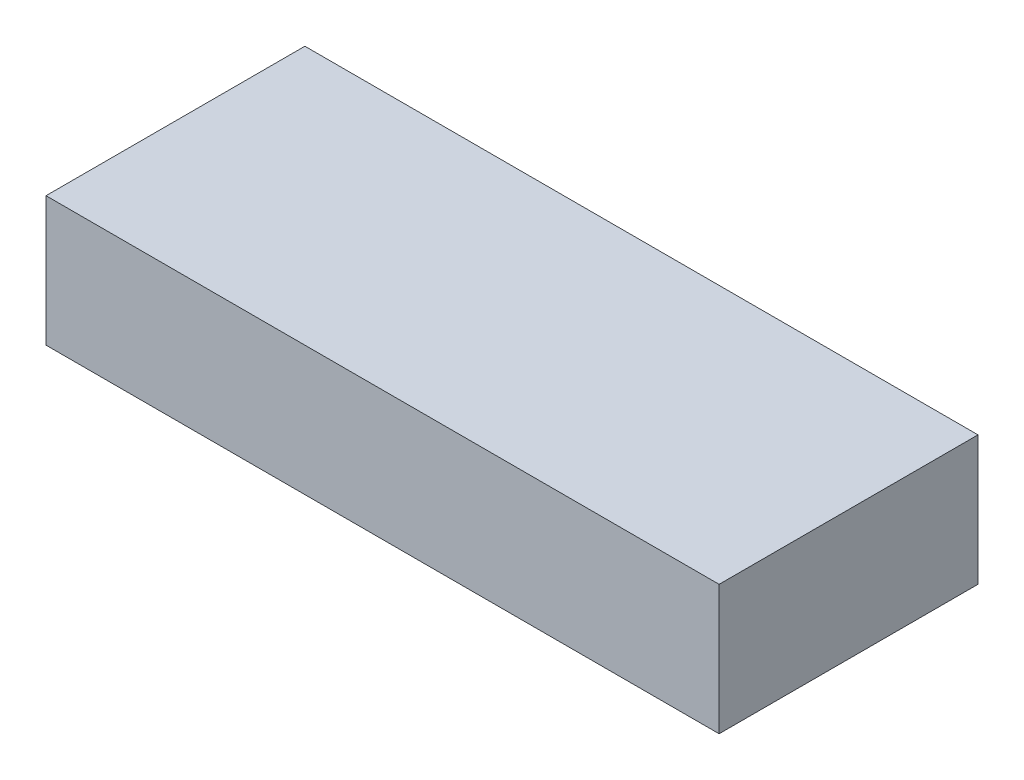
ISO-10303-21;
HEADER;
FILE_DESCRIPTION(('STEP AP214'),'2;1');
FILE_NAME('part.step','',(''),(''),'','','');
FILE_SCHEMA(('AUTOMOTIVE_DESIGN { 1 0 10303 214 1 1 1 1 }'));
ENDSEC;
DATA;
#1=APPLICATION_CONTEXT('core data for automotive mechanical design processes');
#2=APPLICATION_PROTOCOL_DEFINITION('international standard','automotive_design',2000,#1);
#3=PRODUCT_CONTEXT('',#1,'mechanical');
#4=PRODUCT('Part','Part','',(#3));
#5=PRODUCT_RELATED_PRODUCT_CATEGORY('part','',(#4));
#6=PRODUCT_DEFINITION_FORMATION('','',#4);
#7=PRODUCT_DEFINITION_CONTEXT('part definition',#1,'design');
#8=PRODUCT_DEFINITION('design','',#6,#7);
#9=PRODUCT_DEFINITION_SHAPE('','',#8);
#10=(LENGTH_UNIT() NAMED_UNIT(*) SI_UNIT(.MILLI.,.METRE.));
#11=(NAMED_UNIT(*) PLANE_ANGLE_UNIT() SI_UNIT($,.RADIAN.));
#12=(NAMED_UNIT(*) SI_UNIT($,.STERADIAN.) SOLID_ANGLE_UNIT());
#13=UNCERTAINTY_MEASURE_WITH_UNIT(LENGTH_MEASURE(1.E-05),#10,'distance_accuracy_value','');
#14=(GEOMETRIC_REPRESENTATION_CONTEXT(3) GLOBAL_UNCERTAINTY_ASSIGNED_CONTEXT((#13)) GLOBAL_UNIT_ASSIGNED_CONTEXT((#10,
#11,#12)) REPRESENTATION_CONTEXT('',''));
#15=CARTESIAN_POINT('',(0.,0.,0.));
#16=DIRECTION('',(0.,0.,1.));
#17=DIRECTION('',(1.,0.,0.));
#18=AXIS2_PLACEMENT_3D('',#15,#16,#17);
#19=CARTESIAN_POINT('',(-0.65000124,0.12500102,0.));
#20=DIRECTION('',(0.,1.,0.));
#21=DIRECTION('',(0.,0.,1.));
#22=AXIS2_PLACEMENT_3D('',#19,#20,#21);
#23=PLANE('',#22);
#24=DIRECTION('',(0.,0.,-1.));
#25=VECTOR('',#24,1.);
#26=CARTESIAN_POINT('',(0.65000124,0.12500102,0.));
#27=LINE('',#26,#25);
#28=CARTESIAN_POINT('',(0.65000124,0.12500102,0.));
#29=VERTEX_POINT('',#28);
#30=CARTESIAN_POINT('',(0.65000124,0.12500102,0.499999));
#31=VERTEX_POINT('',#30);
#32=EDGE_CURVE('E20',#29,#31,#27,.F.);
#33=ORIENTED_EDGE('',*,*,#32,.F.);
#34=DIRECTION('',(1.,0.,0.));
#35=VECTOR('',#34,1.);
#36=CARTESIAN_POINT('',(0.65000124,0.12500102,0.));
#37=LINE('',#36,#35);
#38=CARTESIAN_POINT('',(-0.65000124,0.12500102,0.));
#39=VERTEX_POINT('',#38);
#40=EDGE_CURVE('E80',#29,#39,#37,.F.);
#41=ORIENTED_EDGE('',*,*,#40,.T.);
#42=DIRECTION('',(0.,0.,1.));
#43=VECTOR('',#42,1.);
#44=CARTESIAN_POINT('',(-0.65000124,0.12500102,0.));
#45=LINE('',#44,#43);
#46=CARTESIAN_POINT('',(-0.65000124,0.12500102,0.499999));
#47=VERTEX_POINT('',#46);
#48=EDGE_CURVE('E68',#47,#39,#45,.F.);
#49=ORIENTED_EDGE('',*,*,#48,.F.);
#50=DIRECTION('',(1.,0.,0.));
#51=VECTOR('',#50,1.);
#52=CARTESIAN_POINT('',(0.65000124,0.12500102,0.499999));
#53=LINE('',#52,#51);
#54=EDGE_CURVE('E56',#31,#47,#53,.F.);
#55=ORIENTED_EDGE('',*,*,#54,.F.);
#56=EDGE_LOOP('',(#33,#41,#49,#55));
#57=FACE_BOUND('',#56,.T.);
#58=ADVANCED_FACE('F17',(#57),#23,.T.);
#59=CARTESIAN_POINT('',(0.65000124,0.12500102,0.));
#60=DIRECTION('',(1.,0.,0.));
#61=DIRECTION('',(0.,0.,-1.));
#62=AXIS2_PLACEMENT_3D('',#59,#60,#61);
#63=PLANE('',#62);
#64=DIRECTION('',(0.,0.,-1.));
#65=VECTOR('',#64,1.);
#66=CARTESIAN_POINT('',(0.65000124,-0.12499848,0.));
#67=LINE('',#66,#65);
#68=CARTESIAN_POINT('',(0.65000124,-0.12499848,0.));
#69=VERTEX_POINT('',#68);
#70=CARTESIAN_POINT('',(0.65000124,-0.12499848,0.499999));
#71=VERTEX_POINT('',#70);
#72=EDGE_CURVE('E83',#69,#71,#67,.F.);
#73=ORIENTED_EDGE('',*,*,#72,.F.);
#74=DIRECTION('',(0.,1.,0.));
#75=VECTOR('',#74,1.);
#76=CARTESIAN_POINT('',(0.65000124,-0.12499848,0.));
#77=LINE('',#76,#75);
#78=EDGE_CURVE('E65',#69,#29,#77,.T.);
#79=ORIENTED_EDGE('',*,*,#78,.T.);
#80=ORIENTED_EDGE('',*,*,#32,.T.);
#81=DIRECTION('',(0.,1.,0.));
#82=VECTOR('',#81,1.);
#83=CARTESIAN_POINT('',(0.65000124,-0.12499848,0.499999));
#84=LINE('',#83,#82);
#85=EDGE_CURVE('E62',#71,#31,#84,.T.);
#86=ORIENTED_EDGE('',*,*,#85,.F.);
#87=EDGE_LOOP('',(#73,#79,#80,#86));
#88=FACE_BOUND('',#87,.T.);
#89=ADVANCED_FACE('F61',(#88),#63,.T.);
#90=CARTESIAN_POINT('',(0.65000124,-0.12499848,0.499999));
#91=DIRECTION('',(0.,0.,1.));
#92=DIRECTION('',(1.,0.,0.));
#93=AXIS2_PLACEMENT_3D('',#90,#91,#92);
#94=PLANE('',#93);
#95=DIRECTION('',(0.,1.,0.));
#96=VECTOR('',#95,1.);
#97=CARTESIAN_POINT('',(-0.65000124,-0.12499848,0.499999));
#98=LINE('',#97,#96);
#99=CARTESIAN_POINT('',(-0.65000124,-0.12499848,0.499999));
#100=VERTEX_POINT('',#99);
#101=EDGE_CURVE('E70',#100,#47,#98,.T.);
#102=ORIENTED_EDGE('',*,*,#101,.F.);
#103=DIRECTION('',(1.,0.,0.));
#104=VECTOR('',#103,1.);
#105=CARTESIAN_POINT('',(0.65000124,-0.12499848,0.499999));
#106=LINE('',#105,#104);
#107=EDGE_CURVE('E74',#71,#100,#106,.F.);
#108=ORIENTED_EDGE('',*,*,#107,.F.);
#109=ORIENTED_EDGE('',*,*,#85,.T.);
#110=ORIENTED_EDGE('',*,*,#54,.T.);
#111=EDGE_LOOP('',(#102,#108,#109,#110));
#112=FACE_BOUND('',#111,.T.);
#113=ADVANCED_FACE('F72',(#112),#94,.T.);
#114=CARTESIAN_POINT('',(-0.65000124,-0.12499848,0.));
#115=DIRECTION('',(-1.,0.,0.));
#116=DIRECTION('',(0.,0.,1.));
#117=AXIS2_PLACEMENT_3D('',#114,#115,#116);
#118=PLANE('',#117);
#119=ORIENTED_EDGE('',*,*,#48,.T.);
#120=DIRECTION('',(0.,1.,0.));
#121=VECTOR('',#120,1.);
#122=CARTESIAN_POINT('',(-0.65000124,-0.12499848,0.));
#123=LINE('',#122,#121);
#124=CARTESIAN_POINT('',(-0.65000124,-0.12499848,0.));
#125=VERTEX_POINT('',#124);
#126=EDGE_CURVE('E35',#39,#125,#123,.F.);
#127=ORIENTED_EDGE('',*,*,#126,.T.);
#128=DIRECTION('',(0.,0.,-1.));
#129=VECTOR('',#128,1.);
#130=CARTESIAN_POINT('',(-0.65000124,-0.12499848,0.));
#131=LINE('',#130,#129);
#132=EDGE_CURVE('E26',#100,#125,#131,.T.);
#133=ORIENTED_EDGE('',*,*,#132,.F.);
#134=ORIENTED_EDGE('',*,*,#101,.T.);
#135=EDGE_LOOP('',(#119,#127,#133,#134));
#136=FACE_BOUND('',#135,.T.);
#137=ADVANCED_FACE('F89',(#136),#118,.T.);
#138=CARTESIAN_POINT('',(0.65000124,-0.12499848,0.));
#139=DIRECTION('',(0.,0.,1.));
#140=DIRECTION('',(1.,0.,0.));
#141=AXIS2_PLACEMENT_3D('',#138,#139,#140);
#142=PLANE('',#141);
#143=ORIENTED_EDGE('',*,*,#126,.F.);
#144=ORIENTED_EDGE('',*,*,#40,.F.);
#145=ORIENTED_EDGE('',*,*,#78,.F.);
#146=DIRECTION('',(1.,0.,0.));
#147=VECTOR('',#146,1.);
#148=CARTESIAN_POINT('',(0.65000124,-0.12499848,0.));
#149=LINE('',#148,#147);
#150=EDGE_CURVE('E11',#125,#69,#149,.T.);
#151=ORIENTED_EDGE('',*,*,#150,.F.);
#152=EDGE_LOOP('',(#143,#144,#145,#151));
#153=FACE_BOUND('',#152,.T.);
#154=ADVANCED_FACE('F91',(#153),#142,.F.);
#155=CARTESIAN_POINT('',(0.65000124,-0.12499848,0.));
#156=DIRECTION('',(0.,-1.,0.));
#157=DIRECTION('',(0.,0.,-1.));
#158=AXIS2_PLACEMENT_3D('',#155,#156,#157);
#159=PLANE('',#158);
#160=ORIENTED_EDGE('',*,*,#132,.T.);
#161=ORIENTED_EDGE('',*,*,#150,.T.);
#162=ORIENTED_EDGE('',*,*,#72,.T.);
#163=ORIENTED_EDGE('',*,*,#107,.T.);
#164=EDGE_LOOP('',(#160,#161,#162,#163));
#165=FACE_BOUND('',#164,.T.);
#166=ADVANCED_FACE('F88',(#165),#159,.T.);
#167=CLOSED_SHELL('',(#58,#89,#113,#137,#154,#166));
#168=MANIFOLD_SOLID_BREP('B1',#167);
#169=ADVANCED_BREP_SHAPE_REPRESENTATION('',(#18,#168),#14);
#170=SHAPE_DEFINITION_REPRESENTATION(#9,#169);
ENDSEC;
END-ISO-10303-21;
